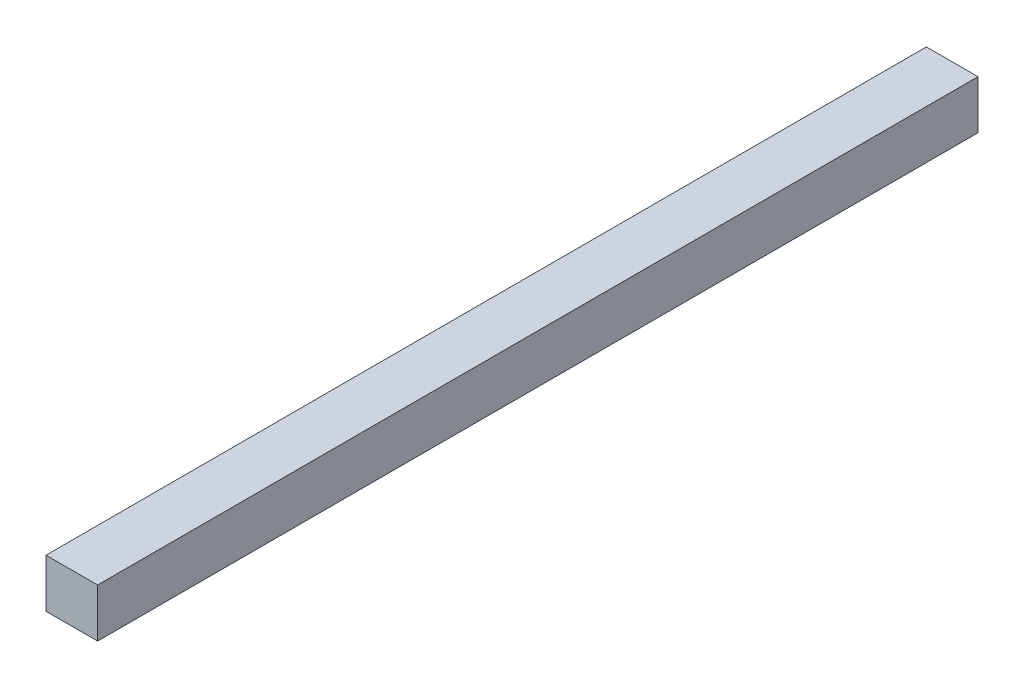
ISO-10303-21;
HEADER;
FILE_DESCRIPTION(('STEP AP214'),'2;1');
FILE_NAME('part.step','',(''),(''),'','','');
FILE_SCHEMA(('AUTOMOTIVE_DESIGN { 1 0 10303 214 1 1 1 1 }'));
ENDSEC;
DATA;
#1=APPLICATION_CONTEXT('core data for automotive mechanical design processes');
#2=APPLICATION_PROTOCOL_DEFINITION('international standard','automotive_design',2000,#1);
#3=PRODUCT_CONTEXT('',#1,'mechanical');
#4=PRODUCT('Part','Part','',(#3));
#5=PRODUCT_RELATED_PRODUCT_CATEGORY('part','',(#4));
#6=PRODUCT_DEFINITION_FORMATION('','',#4);
#7=PRODUCT_DEFINITION_CONTEXT('part definition',#1,'design');
#8=PRODUCT_DEFINITION('design','',#6,#7);
#9=PRODUCT_DEFINITION_SHAPE('','',#8);
#10=(LENGTH_UNIT() NAMED_UNIT(*) SI_UNIT(.MILLI.,.METRE.));
#11=(NAMED_UNIT(*) PLANE_ANGLE_UNIT() SI_UNIT($,.RADIAN.));
#12=(NAMED_UNIT(*) SI_UNIT($,.STERADIAN.) SOLID_ANGLE_UNIT());
#13=UNCERTAINTY_MEASURE_WITH_UNIT(LENGTH_MEASURE(1.E-05),#10,'distance_accuracy_value','');
#14=(GEOMETRIC_REPRESENTATION_CONTEXT(3) GLOBAL_UNCERTAINTY_ASSIGNED_CONTEXT((#13)) GLOBAL_UNIT_ASSIGNED_CONTEXT((#10,
#11,#12)) REPRESENTATION_CONTEXT('',''));
#15=CARTESIAN_POINT('',(0.,0.,0.));
#16=DIRECTION('',(0.,0.,1.));
#17=DIRECTION('',(1.,0.,0.));
#18=AXIS2_PLACEMENT_3D('',#15,#16,#17);
#19=CARTESIAN_POINT('',(0.255,0.24,-3.2));
#20=DIRECTION('',(0.,1.,0.));
#21=DIRECTION('',(0.,0.,1.));
#22=AXIS2_PLACEMENT_3D('',#19,#20,#21);
#23=PLANE('',#22);
#24=DIRECTION('',(1.,0.,0.));
#25=VECTOR('',#24,1.);
#26=CARTESIAN_POINT('',(0.,0.24,0.));
#27=LINE('',#26,#25);
#28=CARTESIAN_POINT('',(0.255,0.24,0.));
#29=VERTEX_POINT('',#28);
#30=CARTESIAN_POINT('',(-0.255,0.24,0.));
#31=VERTEX_POINT('',#30);
#32=EDGE_CURVE('E55',#29,#31,#27,.F.);
#33=ORIENTED_EDGE('',*,*,#32,.F.);
#34=DIRECTION('',(0.,0.,-1.));
#35=VECTOR('',#34,1.);
#36=CARTESIAN_POINT('',(0.255,0.24,-3.2));
#37=LINE('',#36,#35);
#38=CARTESIAN_POINT('',(0.255,0.24,-8.7));
#39=VERTEX_POINT('',#38);
#40=EDGE_CURVE('E67',#39,#29,#37,.F.);
#41=ORIENTED_EDGE('',*,*,#40,.F.);
#42=DIRECTION('',(1.,0.,0.));
#43=VECTOR('',#42,1.);
#44=CARTESIAN_POINT('',(0.,0.24,-8.7));
#45=LINE('',#44,#43);
#46=CARTESIAN_POINT('',(-0.255,0.24,-8.7));
#47=VERTEX_POINT('',#46);
#48=EDGE_CURVE('E20',#39,#47,#45,.F.);
#49=ORIENTED_EDGE('',*,*,#48,.T.);
#50=DIRECTION('',(0.,0.,1.));
#51=VECTOR('',#50,1.);
#52=CARTESIAN_POINT('',(-0.255,0.24,-3.2));
#53=LINE('',#52,#51);
#54=EDGE_CURVE('E81',#31,#47,#53,.F.);
#55=ORIENTED_EDGE('',*,*,#54,.F.);
#56=EDGE_LOOP('',(#33,#41,#49,#55));
#57=FACE_BOUND('',#56,.T.);
#58=ADVANCED_FACE('F17',(#57),#23,.T.);
#59=CARTESIAN_POINT('',(0.,0.,-8.7));
#60=DIRECTION('',(0.,0.,1.));
#61=DIRECTION('',(1.,0.,0.));
#62=AXIS2_PLACEMENT_3D('',#59,#60,#61);
#63=PLANE('',#62);
#64=ORIENTED_EDGE('',*,*,#48,.F.);
#65=DIRECTION('',(0.,1.,0.));
#66=VECTOR('',#65,1.);
#67=CARTESIAN_POINT('',(0.255,-0.24,-8.7));
#68=LINE('',#67,#66);
#69=CARTESIAN_POINT('',(0.255,-0.24,-8.7));
#70=VERTEX_POINT('',#69);
#71=EDGE_CURVE('E62',#70,#39,#68,.T.);
#72=ORIENTED_EDGE('',*,*,#71,.F.);
#73=DIRECTION('',(1.,0.,0.));
#74=VECTOR('',#73,1.);
#75=CARTESIAN_POINT('',(-0.255,-0.24,-8.7));
#76=LINE('',#75,#74);
#77=CARTESIAN_POINT('',(-0.255,-0.24,-8.7));
#78=VERTEX_POINT('',#77);
#79=EDGE_CURVE('E83',#78,#70,#76,.T.);
#80=ORIENTED_EDGE('',*,*,#79,.F.);
#81=DIRECTION('',(0.,1.,0.));
#82=VECTOR('',#81,1.);
#83=CARTESIAN_POINT('',(-0.255,0.24,-8.7));
#84=LINE('',#83,#82);
#85=EDGE_CURVE('E65',#47,#78,#84,.F.);
#86=ORIENTED_EDGE('',*,*,#85,.F.);
#87=EDGE_LOOP('',(#64,#72,#80,#86));
#88=FACE_BOUND('',#87,.T.);
#89=ADVANCED_FACE('F60',(#88),#63,.F.);
#90=CARTESIAN_POINT('',(0.255,-0.24,-3.2));
#91=DIRECTION('',(1.,0.,0.));
#92=DIRECTION('',(0.,0.,-1.));
#93=AXIS2_PLACEMENT_3D('',#90,#91,#92);
#94=PLANE('',#93);
#95=DIRECTION('',(0.,1.,0.));
#96=VECTOR('',#95,1.);
#97=CARTESIAN_POINT('',(0.255,0.,0.));
#98=LINE('',#97,#96);
#99=CARTESIAN_POINT('',(0.255,-0.24,0.));
#100=VERTEX_POINT('',#99);
#101=EDGE_CURVE('E77',#100,#29,#98,.T.);
#102=ORIENTED_EDGE('',*,*,#101,.F.);
#103=DIRECTION('',(0.,0.,-1.));
#104=VECTOR('',#103,1.);
#105=CARTESIAN_POINT('',(0.255,-0.24,-3.2));
#106=LINE('',#105,#104);
#107=EDGE_CURVE('E73',#70,#100,#106,.F.);
#108=ORIENTED_EDGE('',*,*,#107,.F.);
#109=ORIENTED_EDGE('',*,*,#71,.T.);
#110=ORIENTED_EDGE('',*,*,#40,.T.);
#111=EDGE_LOOP('',(#102,#108,#109,#110));
#112=FACE_BOUND('',#111,.T.);
#113=ADVANCED_FACE('F71',(#112),#94,.T.);
#114=CARTESIAN_POINT('',(0.,0.,0.));
#115=DIRECTION('',(0.,0.,1.));
#116=DIRECTION('',(1.,0.,0.));
#117=AXIS2_PLACEMENT_3D('',#114,#115,#116);
#118=PLANE('',#117);
#119=DIRECTION('',(1.,0.,0.));
#120=VECTOR('',#119,1.);
#121=CARTESIAN_POINT('',(-0.255,-0.24,0.));
#122=LINE('',#121,#120);
#123=CARTESIAN_POINT('',(-0.255,-0.24,0.));
#124=VERTEX_POINT('',#123);
#125=EDGE_CURVE('E26',#100,#124,#122,.F.);
#126=ORIENTED_EDGE('',*,*,#125,.F.);
#127=ORIENTED_EDGE('',*,*,#101,.T.);
#128=ORIENTED_EDGE('',*,*,#32,.T.);
#129=DIRECTION('',(0.,1.,0.));
#130=VECTOR('',#129,1.);
#131=CARTESIAN_POINT('',(-0.255,0.24,0.));
#132=LINE('',#131,#130);
#133=EDGE_CURVE('E35',#124,#31,#132,.T.);
#134=ORIENTED_EDGE('',*,*,#133,.F.);
#135=EDGE_LOOP('',(#126,#127,#128,#134));
#136=FACE_BOUND('',#135,.T.);
#137=ADVANCED_FACE('F89',(#136),#118,.T.);
#138=CARTESIAN_POINT('',(-0.255,0.24,-3.2));
#139=DIRECTION('',(-1.,0.,0.));
#140=DIRECTION('',(0.,0.,1.));
#141=AXIS2_PLACEMENT_3D('',#138,#139,#140);
#142=PLANE('',#141);
#143=ORIENTED_EDGE('',*,*,#133,.T.);
#144=ORIENTED_EDGE('',*,*,#54,.T.);
#145=ORIENTED_EDGE('',*,*,#85,.T.);
#146=DIRECTION('',(0.,0.,-1.));
#147=VECTOR('',#146,1.);
#148=CARTESIAN_POINT('',(-0.255000000000001,-0.24,-3.2));
#149=LINE('',#148,#147);
#150=EDGE_CURVE('E11',#124,#78,#149,.T.);
#151=ORIENTED_EDGE('',*,*,#150,.F.);
#152=EDGE_LOOP('',(#143,#144,#145,#151));
#153=FACE_BOUND('',#152,.T.);
#154=ADVANCED_FACE('F91',(#153),#142,.T.);
#155=CARTESIAN_POINT('',(-0.255,-0.24,-3.2));
#156=DIRECTION('',(0.,-1.,0.));
#157=DIRECTION('',(0.,0.,-1.));
#158=AXIS2_PLACEMENT_3D('',#155,#156,#157);
#159=PLANE('',#158);
#160=ORIENTED_EDGE('',*,*,#125,.T.);
#161=ORIENTED_EDGE('',*,*,#150,.T.);
#162=ORIENTED_EDGE('',*,*,#79,.T.);
#163=ORIENTED_EDGE('',*,*,#107,.T.);
#164=EDGE_LOOP('',(#160,#161,#162,#163));
#165=FACE_BOUND('',#164,.T.);
#166=ADVANCED_FACE('F88',(#165),#159,.T.);
#167=CLOSED_SHELL('',(#58,#89,#113,#137,#154,#166));
#168=MANIFOLD_SOLID_BREP('B1',#167);
#169=ADVANCED_BREP_SHAPE_REPRESENTATION('',(#18,#168),#14);
#170=SHAPE_DEFINITION_REPRESENTATION(#9,#169);
ENDSEC;
END-ISO-10303-21;
